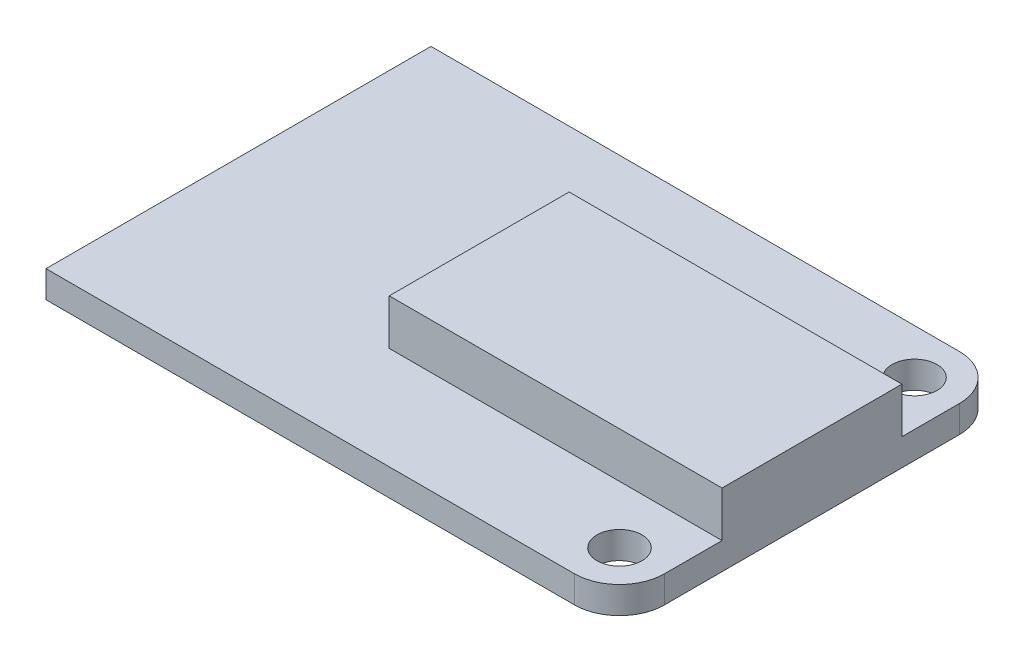
ISO-10303-21;
HEADER;
FILE_DESCRIPTION(('STEP AP214'),'2;1');
FILE_NAME('part.step','',(''),(''),'','','');
FILE_SCHEMA(('AUTOMOTIVE_DESIGN { 1 0 10303 214 1 1 1 1 }'));
ENDSEC;
DATA;
#1=APPLICATION_CONTEXT('core data for automotive mechanical design processes');
#2=APPLICATION_PROTOCOL_DEFINITION('international standard','automotive_design',2000,#1);
#3=PRODUCT_CONTEXT('',#1,'mechanical');
#4=PRODUCT('Part','Part','',(#3));
#5=PRODUCT_RELATED_PRODUCT_CATEGORY('part','',(#4));
#6=PRODUCT_DEFINITION_FORMATION('','',#4);
#7=PRODUCT_DEFINITION_CONTEXT('part definition',#1,'design');
#8=PRODUCT_DEFINITION('design','',#6,#7);
#9=PRODUCT_DEFINITION_SHAPE('','',#8);
#10=(LENGTH_UNIT() NAMED_UNIT(*) SI_UNIT(.MILLI.,.METRE.));
#11=(NAMED_UNIT(*) PLANE_ANGLE_UNIT() SI_UNIT($,.RADIAN.));
#12=(NAMED_UNIT(*) SI_UNIT($,.STERADIAN.) SOLID_ANGLE_UNIT());
#13=UNCERTAINTY_MEASURE_WITH_UNIT(LENGTH_MEASURE(1.E-05),#10,'distance_accuracy_value','');
#14=(GEOMETRIC_REPRESENTATION_CONTEXT(3) GLOBAL_UNCERTAINTY_ASSIGNED_CONTEXT((#13)) GLOBAL_UNIT_ASSIGNED_CONTEXT((#10,
#11,#12)) REPRESENTATION_CONTEXT('',''));
#15=CARTESIAN_POINT('',(0.,0.,0.));
#16=DIRECTION('',(0.,0.,1.));
#17=DIRECTION('',(1.,0.,0.));
#18=AXIS2_PLACEMENT_3D('',#15,#16,#17);
#19=CARTESIAN_POINT('',(31.88,1.5,0.));
#20=DIRECTION('',(-1.,0.,0.));
#21=DIRECTION('',(0.,0.,1.));
#22=AXIS2_PLACEMENT_3D('',#19,#20,#21);
#23=PLANE('',#22);
#24=DIRECTION('',(0.,0.,-1.));
#25=VECTOR('',#24,1.);
#26=CARTESIAN_POINT('',(31.88,0.,0.));
#27=LINE('',#26,#25);
#28=CARTESIAN_POINT('',(31.88,0.,-2.50000000000002));
#29=VERTEX_POINT('',#28);
#30=CARTESIAN_POINT('',(31.88,0.,-18.9));
#31=VERTEX_POINT('',#30);
#32=EDGE_CURVE('E165',#29,#31,#27,.T.);
#33=ORIENTED_EDGE('',*,*,#32,.T.);
#34=DIRECTION('',(0.,-1.,0.));
#35=VECTOR('',#34,1.);
#36=CARTESIAN_POINT('',(31.88,1.5,-18.9));
#37=LINE('',#36,#35);
#38=CARTESIAN_POINT('',(31.88,1.5,-18.9));
#39=VERTEX_POINT('',#38);
#40=EDGE_CURVE('E11',#39,#31,#37,.T.);
#41=ORIENTED_EDGE('',*,*,#40,.F.);
#42=DIRECTION('',(0.,0.,-1.));
#43=VECTOR('',#42,1.);
#44=CARTESIAN_POINT('',(31.88,1.5,0.));
#45=LINE('',#44,#43);
#46=CARTESIAN_POINT('',(31.88,1.5,-15.7));
#47=VERTEX_POINT('',#46);
#48=EDGE_CURVE('E146',#47,#39,#45,.T.);
#49=ORIENTED_EDGE('',*,*,#48,.F.);
#50=DIRECTION('',(0.,-1.,0.));
#51=VECTOR('',#50,1.);
#52=CARTESIAN_POINT('',(31.88,4.03,-15.7));
#53=LINE('',#52,#51);
#54=CARTESIAN_POINT('',(31.88,4.03,-15.7));
#55=VERTEX_POINT('',#54);
#56=EDGE_CURVE('E135',#55,#47,#53,.T.);
#57=ORIENTED_EDGE('',*,*,#56,.F.);
#58=DIRECTION('',(0.,0.,-1.));
#59=VECTOR('',#58,1.);
#60=CARTESIAN_POINT('',(31.88,4.03,-15.7));
#61=LINE('',#60,#59);
#62=CARTESIAN_POINT('',(31.88,4.03,-5.7));
#63=VERTEX_POINT('',#62);
#64=EDGE_CURVE('E117',#63,#55,#61,.T.);
#65=ORIENTED_EDGE('',*,*,#64,.F.);
#66=DIRECTION('',(0.,-1.,0.));
#67=VECTOR('',#66,1.);
#68=CARTESIAN_POINT('',(31.88,4.03,-5.7));
#69=LINE('',#68,#67);
#70=CARTESIAN_POINT('',(31.88,1.5,-5.7));
#71=VERTEX_POINT('',#70);
#72=EDGE_CURVE('E114',#63,#71,#69,.T.);
#73=ORIENTED_EDGE('',*,*,#72,.T.);
#74=CARTESIAN_POINT('',(31.88,1.5,-2.50000000000002));
#75=VERTEX_POINT('',#74);
#76=EDGE_CURVE('E147',#75,#71,#45,.T.);
#77=ORIENTED_EDGE('',*,*,#76,.F.);
#78=DIRECTION('',(0.,-1.,0.));
#79=VECTOR('',#78,1.);
#80=CARTESIAN_POINT('',(31.88,1.5,-2.50000000000002));
#81=LINE('',#80,#79);
#82=EDGE_CURVE('E161',#75,#29,#81,.T.);
#83=ORIENTED_EDGE('',*,*,#82,.T.);
#84=EDGE_LOOP('',(#33,#41,#49,#57,#65,#73,#77,#83));
#85=FACE_BOUND('',#84,.T.);
#86=ADVANCED_FACE('F33',(#85),#23,.F.);
#87=CARTESIAN_POINT('',(29.38,1.5,-18.9));
#88=DIRECTION('',(0.,-1.,0.));
#89=DIRECTION('',(0.,0.,-1.));
#90=AXIS2_PLACEMENT_3D('',#87,#88,#89);
#91=CYLINDRICAL_SURFACE('',#90,2.5);
#92=CARTESIAN_POINT('',(29.38,0.,-18.9));
#93=DIRECTION('',(0.,1.,0.));
#94=DIRECTION('',(0.,0.,1.));
#95=AXIS2_PLACEMENT_3D('',#92,#93,#94);
#96=CIRCLE('',#95,2.5);
#97=CARTESIAN_POINT('',(29.38,0.,-21.4));
#98=VERTEX_POINT('',#97);
#99=EDGE_CURVE('E168',#31,#98,#96,.T.);
#100=ORIENTED_EDGE('',*,*,#99,.T.);
#101=DIRECTION('',(0.,-1.,0.));
#102=VECTOR('',#101,1.);
#103=CARTESIAN_POINT('',(29.38,1.5,-21.4));
#104=LINE('',#103,#102);
#105=CARTESIAN_POINT('',(29.38,1.5,-21.4));
#106=VERTEX_POINT('',#105);
#107=EDGE_CURVE('E41',#106,#98,#104,.T.);
#108=ORIENTED_EDGE('',*,*,#107,.F.);
#109=CARTESIAN_POINT('',(29.38,1.5,-18.9));
#110=DIRECTION('',(0.,1.,0.));
#111=DIRECTION('',(0.,0.,1.));
#112=AXIS2_PLACEMENT_3D('',#109,#110,#111);
#113=CIRCLE('',#112,2.5);
#114=EDGE_CURVE('E149',#39,#106,#113,.T.);
#115=ORIENTED_EDGE('',*,*,#114,.F.);
#116=ORIENTED_EDGE('',*,*,#40,.T.);
#117=EDGE_LOOP('',(#100,#108,#115,#116));
#118=FACE_BOUND('',#117,.T.);
#119=ADVANCED_FACE('F195',(#118),#91,.T.);
#120=CARTESIAN_POINT('',(0.,1.5,-21.4));
#121=DIRECTION('',(0.,0.,-1.));
#122=DIRECTION('',(-1.,0.,0.));
#123=AXIS2_PLACEMENT_3D('',#120,#121,#122);
#124=PLANE('',#123);
#125=DIRECTION('',(1.,0.,0.));
#126=VECTOR('',#125,1.);
#127=CARTESIAN_POINT('',(0.,0.,-21.4));
#128=LINE('',#127,#126);
#129=CARTESIAN_POINT('',(0.,0.,-21.4));
#130=VERTEX_POINT('',#129);
#131=EDGE_CURVE('E171',#130,#98,#128,.T.);
#132=ORIENTED_EDGE('',*,*,#131,.F.);
#133=DIRECTION('',(0.,-1.,0.));
#134=VECTOR('',#133,1.);
#135=CARTESIAN_POINT('',(0.,1.5,-21.4));
#136=LINE('',#135,#134);
#137=CARTESIAN_POINT('',(0.,1.5,-21.4));
#138=VERTEX_POINT('',#137);
#139=EDGE_CURVE('E187',#138,#130,#136,.T.);
#140=ORIENTED_EDGE('',*,*,#139,.F.);
#141=DIRECTION('',(1.,0.,0.));
#142=VECTOR('',#141,1.);
#143=CARTESIAN_POINT('',(0.,1.5,-21.4));
#144=LINE('',#143,#142);
#145=EDGE_CURVE('E151',#138,#106,#144,.T.);
#146=ORIENTED_EDGE('',*,*,#145,.T.);
#147=ORIENTED_EDGE('',*,*,#107,.T.);
#148=EDGE_LOOP('',(#132,#140,#146,#147));
#149=FACE_BOUND('',#148,.T.);
#150=ADVANCED_FACE('F191',(#149),#124,.T.);
#151=CARTESIAN_POINT('',(0.,1.5,0.));
#152=DIRECTION('',(-1.,0.,0.));
#153=DIRECTION('',(0.,0.,1.));
#154=AXIS2_PLACEMENT_3D('',#151,#152,#153);
#155=PLANE('',#154);
#156=DIRECTION('',(0.,0.,-1.));
#157=VECTOR('',#156,1.);
#158=CARTESIAN_POINT('',(0.,0.,0.));
#159=LINE('',#158,#157);
#160=CARTESIAN_POINT('',(0.,0.,0.));
#161=VERTEX_POINT('',#160);
#162=EDGE_CURVE('E174',#161,#130,#159,.T.);
#163=ORIENTED_EDGE('',*,*,#162,.F.);
#164=DIRECTION('',(0.,-1.,0.));
#165=VECTOR('',#164,1.);
#166=CARTESIAN_POINT('',(0.,1.5,0.));
#167=LINE('',#166,#165);
#168=CARTESIAN_POINT('',(0.,1.5,0.));
#169=VERTEX_POINT('',#168);
#170=EDGE_CURVE('E185',#169,#161,#167,.T.);
#171=ORIENTED_EDGE('',*,*,#170,.F.);
#172=DIRECTION('',(0.,0.,-1.));
#173=VECTOR('',#172,1.);
#174=CARTESIAN_POINT('',(0.,1.5,0.));
#175=LINE('',#174,#173);
#176=EDGE_CURVE('E154',#169,#138,#175,.T.);
#177=ORIENTED_EDGE('',*,*,#176,.T.);
#178=ORIENTED_EDGE('',*,*,#139,.T.);
#179=EDGE_LOOP('',(#163,#171,#177,#178));
#180=FACE_BOUND('',#179,.T.);
#181=ADVANCED_FACE('F203',(#180),#155,.T.);
#182=CARTESIAN_POINT('',(0.,1.5,0.));
#183=DIRECTION('',(0.,0.,-1.));
#184=DIRECTION('',(-1.,0.,0.));
#185=AXIS2_PLACEMENT_3D('',#182,#183,#184);
#186=PLANE('',#185);
#187=DIRECTION('',(1.,0.,0.));
#188=VECTOR('',#187,1.);
#189=CARTESIAN_POINT('',(0.,0.,0.));
#190=LINE('',#189,#188);
#191=CARTESIAN_POINT('',(29.38,0.,0.));
#192=VERTEX_POINT('',#191);
#193=EDGE_CURVE('E177',#161,#192,#190,.T.);
#194=ORIENTED_EDGE('',*,*,#193,.T.);
#195=DIRECTION('',(0.,-1.,0.));
#196=VECTOR('',#195,1.);
#197=CARTESIAN_POINT('',(29.38,1.5,0.));
#198=LINE('',#197,#196);
#199=CARTESIAN_POINT('',(29.38,1.5,0.));
#200=VERTEX_POINT('',#199);
#201=EDGE_CURVE('E183',#200,#192,#198,.T.);
#202=ORIENTED_EDGE('',*,*,#201,.F.);
#203=DIRECTION('',(1.,0.,0.));
#204=VECTOR('',#203,1.);
#205=CARTESIAN_POINT('',(0.,1.5,0.));
#206=LINE('',#205,#204);
#207=EDGE_CURVE('E157',#169,#200,#206,.T.);
#208=ORIENTED_EDGE('',*,*,#207,.F.);
#209=ORIENTED_EDGE('',*,*,#170,.T.);
#210=EDGE_LOOP('',(#194,#202,#208,#209));
#211=FACE_BOUND('',#210,.T.);
#212=ADVANCED_FACE('F219',(#211),#186,.F.);
#213=CARTESIAN_POINT('',(29.38,1.5,-18.9));
#214=DIRECTION('',(0.,-1.,0.));
#215=DIRECTION('',(0.,0.,-1.));
#216=AXIS2_PLACEMENT_3D('',#213,#214,#215);
#217=CYLINDRICAL_SURFACE('',#216,1.25);
#218=CARTESIAN_POINT('',(29.38,1.5,-18.9));
#219=DIRECTION('',(0.,1.,0.));
#220=DIRECTION('',(0.,0.,1.));
#221=AXIS2_PLACEMENT_3D('',#218,#219,#220);
#222=CIRCLE('',#221,1.25);
#223=CARTESIAN_POINT('',(29.38,1.5,-17.65));
#224=VERTEX_POINT('',#223);
#225=EDGE_CURVE('E142',#224,#224,#222,.T.);
#226=ORIENTED_EDGE('',*,*,#225,.T.);
#227=EDGE_LOOP('',(#226));
#228=FACE_BOUND('',#227,.T.);
#229=CARTESIAN_POINT('',(29.38,0.,-18.9));
#230=DIRECTION('',(0.,1.,0.));
#231=DIRECTION('',(0.,0.,1.));
#232=AXIS2_PLACEMENT_3D('',#229,#230,#231);
#233=CIRCLE('',#232,1.25);
#234=CARTESIAN_POINT('',(29.38,0.,-17.65));
#235=VERTEX_POINT('',#234);
#236=EDGE_CURVE('E133',#235,#235,#233,.T.);
#237=ORIENTED_EDGE('',*,*,#236,.F.);
#238=EDGE_LOOP('',(#237));
#239=FACE_BOUND('',#238,.T.);
#240=ADVANCED_FACE('F244',(#228,#239),#217,.F.);
#241=CARTESIAN_POINT('',(29.38,1.5,-2.5));
#242=DIRECTION('',(0.,-1.,0.));
#243=DIRECTION('',(0.,0.,-1.));
#244=AXIS2_PLACEMENT_3D('',#241,#242,#243);
#245=CYLINDRICAL_SURFACE('',#244,1.25);
#246=CARTESIAN_POINT('',(29.38,1.5,-2.5));
#247=DIRECTION('',(0.,1.,0.));
#248=DIRECTION('',(0.,0.,1.));
#249=AXIS2_PLACEMENT_3D('',#246,#247,#248);
#250=CIRCLE('',#249,1.25);
#251=CARTESIAN_POINT('',(29.38,1.5,-1.25));
#252=VERTEX_POINT('',#251);
#253=EDGE_CURVE('E139',#252,#252,#250,.T.);
#254=ORIENTED_EDGE('',*,*,#253,.T.);
#255=EDGE_LOOP('',(#254));
#256=FACE_BOUND('',#255,.T.);
#257=CARTESIAN_POINT('',(29.38,0.,-2.5));
#258=DIRECTION('',(0.,1.,0.));
#259=DIRECTION('',(0.,0.,1.));
#260=AXIS2_PLACEMENT_3D('',#257,#258,#259);
#261=CIRCLE('',#260,1.25);
#262=CARTESIAN_POINT('',(29.38,0.,-1.25));
#263=VERTEX_POINT('',#262);
#264=EDGE_CURVE('E130',#263,#263,#261,.T.);
#265=ORIENTED_EDGE('',*,*,#264,.F.);
#266=EDGE_LOOP('',(#265));
#267=FACE_BOUND('',#266,.T.);
#268=ADVANCED_FACE('F35',(#256,#267),#245,.F.);
#269=CARTESIAN_POINT('',(29.38,1.5,-2.5));
#270=DIRECTION('',(0.,-1.,0.));
#271=DIRECTION('',(0.,0.,-1.));
#272=AXIS2_PLACEMENT_3D('',#269,#270,#271);
#273=CYLINDRICAL_SURFACE('',#272,2.5);
#274=CARTESIAN_POINT('',(29.38,0.,-2.5));
#275=DIRECTION('',(0.,1.,0.));
#276=DIRECTION('',(0.,0.,1.));
#277=AXIS2_PLACEMENT_3D('',#274,#275,#276);
#278=CIRCLE('',#277,2.5);
#279=EDGE_CURVE('E143',#29,#192,#278,.F.);
#280=ORIENTED_EDGE('',*,*,#279,.F.);
#281=ORIENTED_EDGE('',*,*,#82,.F.);
#282=CARTESIAN_POINT('',(29.38,1.5,-2.5));
#283=DIRECTION('',(0.,1.,0.));
#284=DIRECTION('',(0.,0.,1.));
#285=AXIS2_PLACEMENT_3D('',#282,#283,#284);
#286=CIRCLE('',#285,2.5);
#287=EDGE_CURVE('E159',#75,#200,#286,.F.);
#288=ORIENTED_EDGE('',*,*,#287,.T.);
#289=ORIENTED_EDGE('',*,*,#201,.T.);
#290=EDGE_LOOP('',(#280,#281,#288,#289));
#291=FACE_BOUND('',#290,.T.);
#292=ADVANCED_FACE('F215',(#291),#273,.T.);
#293=CARTESIAN_POINT('',(0.,1.5,0.));
#294=DIRECTION('',(0.,1.,0.));
#295=DIRECTION('',(0.,0.,1.));
#296=AXIS2_PLACEMENT_3D('',#293,#294,#295);
#297=PLANE('',#296);
#298=DIRECTION('',(-1.,0.,0.));
#299=VECTOR('',#298,1.);
#300=CARTESIAN_POINT('',(13.38,1.5,-15.7));
#301=LINE('',#300,#299);
#302=CARTESIAN_POINT('',(13.38,1.5,-15.7));
#303=VERTEX_POINT('',#302);
#304=EDGE_CURVE('E127',#47,#303,#301,.T.);
#305=ORIENTED_EDGE('',*,*,#304,.F.);
#306=ORIENTED_EDGE('',*,*,#48,.T.);
#307=ORIENTED_EDGE('',*,*,#114,.T.);
#308=ORIENTED_EDGE('',*,*,#145,.F.);
#309=ORIENTED_EDGE('',*,*,#176,.F.);
#310=ORIENTED_EDGE('',*,*,#207,.T.);
#311=ORIENTED_EDGE('',*,*,#287,.F.);
#312=ORIENTED_EDGE('',*,*,#76,.T.);
#313=DIRECTION('',(1.,0.,0.));
#314=VECTOR('',#313,1.);
#315=CARTESIAN_POINT('',(13.38,1.5,-5.7));
#316=LINE('',#315,#314);
#317=CARTESIAN_POINT('',(13.38,1.5,-5.7));
#318=VERTEX_POINT('',#317);
#319=EDGE_CURVE('E53',#318,#71,#316,.T.);
#320=ORIENTED_EDGE('',*,*,#319,.F.);
#321=DIRECTION('',(0.,0.,1.));
#322=VECTOR('',#321,1.);
#323=CARTESIAN_POINT('',(13.38,1.5,-15.7));
#324=LINE('',#323,#322);
#325=EDGE_CURVE('E48',#303,#318,#324,.T.);
#326=ORIENTED_EDGE('',*,*,#325,.F.);
#327=EDGE_LOOP('',(#305,#306,#307,#308,#309,#310,#311,#312,#320,#326));
#328=FACE_BOUND('',#327,.T.);
#329=ORIENTED_EDGE('',*,*,#253,.F.);
#330=EDGE_LOOP('',(#329));
#331=FACE_BOUND('',#330,.T.);
#332=ORIENTED_EDGE('',*,*,#225,.F.);
#333=EDGE_LOOP('',(#332));
#334=FACE_BOUND('',#333,.T.);
#335=ADVANCED_FACE('F206',(#328,#331,#334),#297,.T.);
#336=CARTESIAN_POINT('',(0.,0.,0.));
#337=DIRECTION('',(0.,1.,0.));
#338=DIRECTION('',(0.,0.,1.));
#339=AXIS2_PLACEMENT_3D('',#336,#337,#338);
#340=PLANE('',#339);
#341=ORIENTED_EDGE('',*,*,#264,.T.);
#342=EDGE_LOOP('',(#341));
#343=FACE_BOUND('',#342,.T.);
#344=ORIENTED_EDGE('',*,*,#236,.T.);
#345=EDGE_LOOP('',(#344));
#346=FACE_BOUND('',#345,.T.);
#347=ORIENTED_EDGE('',*,*,#32,.F.);
#348=ORIENTED_EDGE('',*,*,#279,.T.);
#349=ORIENTED_EDGE('',*,*,#193,.F.);
#350=ORIENTED_EDGE('',*,*,#162,.T.);
#351=ORIENTED_EDGE('',*,*,#131,.T.);
#352=ORIENTED_EDGE('',*,*,#99,.F.);
#353=EDGE_LOOP('',(#347,#348,#349,#350,#351,#352));
#354=FACE_BOUND('',#353,.T.);
#355=ADVANCED_FACE('F199',(#343,#346,#354),#340,.F.);
#356=CARTESIAN_POINT('',(13.38,4.03,-15.7));
#357=DIRECTION('',(1.,0.,0.));
#358=DIRECTION('',(0.,0.,-1.));
#359=AXIS2_PLACEMENT_3D('',#356,#357,#358);
#360=PLANE('',#359);
#361=ORIENTED_EDGE('',*,*,#325,.T.);
#362=DIRECTION('',(0.,-1.,0.));
#363=VECTOR('',#362,1.);
#364=CARTESIAN_POINT('',(13.38,4.03,-5.7));
#365=LINE('',#364,#363);
#366=CARTESIAN_POINT('',(13.38,4.03,-5.7));
#367=VERTEX_POINT('',#366);
#368=EDGE_CURVE('E112',#367,#318,#365,.T.);
#369=ORIENTED_EDGE('',*,*,#368,.F.);
#370=DIRECTION('',(0.,0.,1.));
#371=VECTOR('',#370,1.);
#372=CARTESIAN_POINT('',(13.38,4.03,-15.7));
#373=LINE('',#372,#371);
#374=CARTESIAN_POINT('',(13.38,4.03,-15.7));
#375=VERTEX_POINT('',#374);
#376=EDGE_CURVE('E118',#375,#367,#373,.T.);
#377=ORIENTED_EDGE('',*,*,#376,.F.);
#378=DIRECTION('',(0.,-1.,0.));
#379=VECTOR('',#378,1.);
#380=CARTESIAN_POINT('',(13.38,4.03,-15.7));
#381=LINE('',#380,#379);
#382=EDGE_CURVE('E222',#375,#303,#381,.T.);
#383=ORIENTED_EDGE('',*,*,#382,.T.);
#384=EDGE_LOOP('',(#361,#369,#377,#383));
#385=FACE_BOUND('',#384,.T.);
#386=ADVANCED_FACE('F129',(#385),#360,.F.);
#387=CARTESIAN_POINT('',(13.38,4.03,-5.7));
#388=DIRECTION('',(0.,0.,-1.));
#389=DIRECTION('',(-1.,0.,0.));
#390=AXIS2_PLACEMENT_3D('',#387,#388,#389);
#391=PLANE('',#390);
#392=ORIENTED_EDGE('',*,*,#319,.T.);
#393=ORIENTED_EDGE('',*,*,#72,.F.);
#394=DIRECTION('',(1.,0.,0.));
#395=VECTOR('',#394,1.);
#396=CARTESIAN_POINT('',(13.38,4.03,-5.7));
#397=LINE('',#396,#395);
#398=EDGE_CURVE('E108',#367,#63,#397,.T.);
#399=ORIENTED_EDGE('',*,*,#398,.F.);
#400=ORIENTED_EDGE('',*,*,#368,.T.);
#401=EDGE_LOOP('',(#392,#393,#399,#400));
#402=FACE_BOUND('',#401,.T.);
#403=ADVANCED_FACE('F110',(#402),#391,.F.);
#404=CARTESIAN_POINT('',(13.38,4.03,-15.7));
#405=DIRECTION('',(0.,0.,1.));
#406=DIRECTION('',(1.,0.,0.));
#407=AXIS2_PLACEMENT_3D('',#404,#405,#406);
#408=PLANE('',#407);
#409=ORIENTED_EDGE('',*,*,#304,.T.);
#410=ORIENTED_EDGE('',*,*,#382,.F.);
#411=DIRECTION('',(-1.,0.,0.));
#412=VECTOR('',#411,1.);
#413=CARTESIAN_POINT('',(13.38,4.03,-15.7));
#414=LINE('',#413,#412);
#415=EDGE_CURVE('E123',#55,#375,#414,.T.);
#416=ORIENTED_EDGE('',*,*,#415,.F.);
#417=ORIENTED_EDGE('',*,*,#56,.T.);
#418=EDGE_LOOP('',(#409,#410,#416,#417));
#419=FACE_BOUND('',#418,.T.);
#420=ADVANCED_FACE('F228',(#419),#408,.F.);
#421=CARTESIAN_POINT('',(0.,4.03,0.));
#422=DIRECTION('',(0.,1.,0.));
#423=DIRECTION('',(0.,0.,1.));
#424=AXIS2_PLACEMENT_3D('',#421,#422,#423);
#425=PLANE('',#424);
#426=ORIENTED_EDGE('',*,*,#376,.T.);
#427=ORIENTED_EDGE('',*,*,#398,.T.);
#428=ORIENTED_EDGE('',*,*,#64,.T.);
#429=ORIENTED_EDGE('',*,*,#415,.T.);
#430=EDGE_LOOP('',(#426,#427,#428,#429));
#431=FACE_BOUND('',#430,.T.);
#432=ADVANCED_FACE('F121',(#431),#425,.T.);
#433=CLOSED_SHELL('',(#86,#119,#150,#181,#212,#240,#268,#292,#335,#355,#386,#403,#420,#432));
#434=MANIFOLD_SOLID_BREP('B2',#433);
#435=ADVANCED_BREP_SHAPE_REPRESENTATION('',(#18,#434),#14);
#436=SHAPE_DEFINITION_REPRESENTATION(#9,#435);
ENDSEC;
END-ISO-10303-21;
